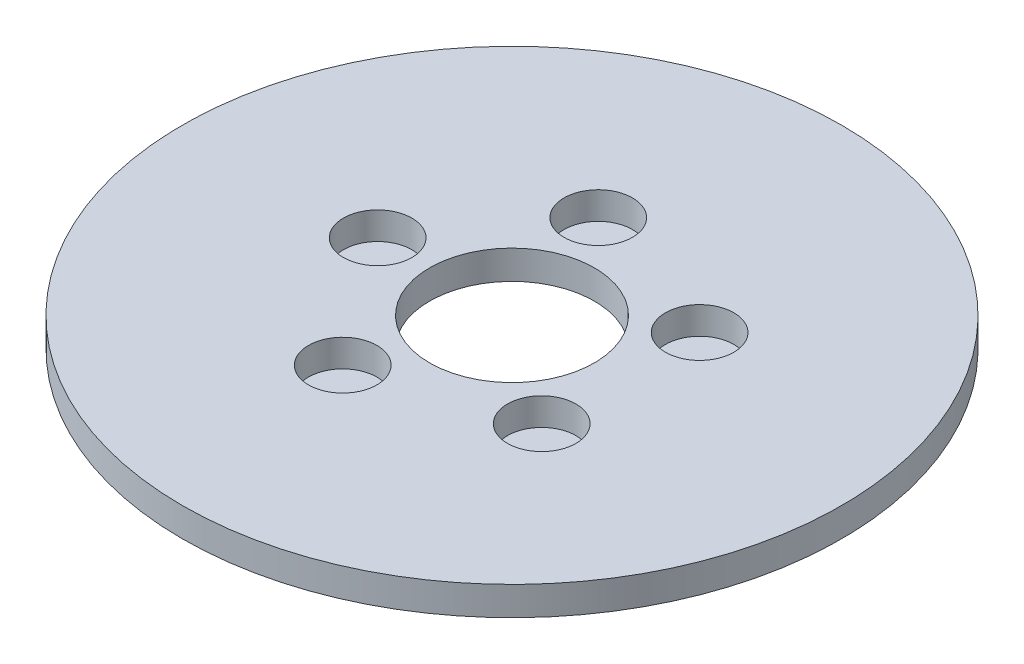
ISO-10303-21;
HEADER;
FILE_DESCRIPTION(('STEP AP214'),'2;1');
FILE_NAME('part.step','',(''),(''),'','','');
FILE_SCHEMA(('AUTOMOTIVE_DESIGN { 1 0 10303 214 1 1 1 1 }'));
ENDSEC;
DATA;
#1=APPLICATION_CONTEXT('core data for automotive mechanical design processes');
#2=APPLICATION_PROTOCOL_DEFINITION('international standard','automotive_design',2000,#1);
#3=PRODUCT_CONTEXT('',#1,'mechanical');
#4=PRODUCT('Part','Part','',(#3));
#5=PRODUCT_RELATED_PRODUCT_CATEGORY('part','',(#4));
#6=PRODUCT_DEFINITION_FORMATION('','',#4);
#7=PRODUCT_DEFINITION_CONTEXT('part definition',#1,'design');
#8=PRODUCT_DEFINITION('design','',#6,#7);
#9=PRODUCT_DEFINITION_SHAPE('','',#8);
#10=(LENGTH_UNIT() NAMED_UNIT(*) SI_UNIT(.MILLI.,.METRE.));
#11=(NAMED_UNIT(*) PLANE_ANGLE_UNIT() SI_UNIT($,.RADIAN.));
#12=(NAMED_UNIT(*) SI_UNIT($,.STERADIAN.) SOLID_ANGLE_UNIT());
#13=UNCERTAINTY_MEASURE_WITH_UNIT(LENGTH_MEASURE(1.E-05),#10,'distance_accuracy_value','');
#14=(GEOMETRIC_REPRESENTATION_CONTEXT(3) GLOBAL_UNCERTAINTY_ASSIGNED_CONTEXT((#13)) GLOBAL_UNIT_ASSIGNED_CONTEXT((#10,
#11,#12)) REPRESENTATION_CONTEXT('',''));
#15=CARTESIAN_POINT('',(0.,0.,0.));
#16=DIRECTION('',(0.,0.,1.));
#17=DIRECTION('',(1.,0.,0.));
#18=AXIS2_PLACEMENT_3D('',#15,#16,#17);
#19=CARTESIAN_POINT('',(0.,7.,0.));
#20=DIRECTION('',(0.,-1.,0.));
#21=DIRECTION('',(0.,0.,-1.));
#22=AXIS2_PLACEMENT_3D('',#19,#20,#21);
#23=CYLINDRICAL_SURFACE('',#22,80.);
#24=CARTESIAN_POINT('',(0.,7.,0.));
#25=DIRECTION('',(0.,1.,0.));
#26=DIRECTION('',(0.,0.,1.));
#27=AXIS2_PLACEMENT_3D('',#24,#25,#26);
#28=CIRCLE('',#27,80.);
#29=CARTESIAN_POINT('',(0.,7.,80.));
#30=VERTEX_POINT('',#29);
#31=EDGE_CURVE('E10',#30,#30,#28,.T.);
#32=ORIENTED_EDGE('',*,*,#31,.F.);
#33=EDGE_LOOP('',(#32));
#34=FACE_BOUND('',#33,.T.);
#35=CARTESIAN_POINT('',(0.,0.,0.));
#36=DIRECTION('',(0.,1.,0.));
#37=DIRECTION('',(0.,0.,1.));
#38=AXIS2_PLACEMENT_3D('',#35,#36,#37);
#39=CIRCLE('',#38,80.);
#40=CARTESIAN_POINT('',(0.,0.,80.));
#41=VERTEX_POINT('',#40);
#42=EDGE_CURVE('E37',#41,#41,#39,.T.);
#43=ORIENTED_EDGE('',*,*,#42,.T.);
#44=EDGE_LOOP('',(#43));
#45=FACE_BOUND('',#44,.T.);
#46=ADVANCED_FACE('F40',(#34,#45),#23,.T.);
#47=CARTESIAN_POINT('',(0.,7.,0.));
#48=DIRECTION('',(0.,1.,0.));
#49=DIRECTION('',(0.,0.,1.));
#50=AXIS2_PLACEMENT_3D('',#47,#48,#49);
#51=PLANE('',#50);
#52=CARTESIAN_POINT('',(-10.0772122075508,7.,-31.0144701117994));
#53=DIRECTION('',(0.,1.,0.));
#54=DIRECTION('',(-0.95105651629515,0.,0.309016994374958));
#55=AXIS2_PLACEMENT_3D('',#52,#53,#54);
#56=CIRCLE('',#55,8.30607325850984);
#57=CARTESIAN_POINT('',(-17.9767573048815,7.,-28.4477523183965));
#58=VERTEX_POINT('',#57);
#59=EDGE_CURVE('E70',#58,#58,#56,.T.);
#60=ORIENTED_EDGE('',*,*,#59,.F.);
#61=EDGE_LOOP('',(#60));
#62=FACE_BOUND('',#61,.T.);
#63=CARTESIAN_POINT('',(26.3824840712123,7.,-19.1679966721601));
#64=DIRECTION('',(0.,1.,0.));
#65=DIRECTION('',(-0.58778525229248,0.,-0.809016994374942));
#66=AXIS2_PLACEMENT_3D('',#63,#64,#65);
#67=CIRCLE('',#66,8.30607325850984);
#68=CARTESIAN_POINT('',(21.5002967053992,7.,-25.8877510948178));
#69=VERTEX_POINT('',#68);
#70=EDGE_CURVE('E71',#69,#69,#67,.T.);
#71=ORIENTED_EDGE('',*,*,#70,.F.);
#72=EDGE_LOOP('',(#71));
#73=FACE_BOUND('',#72,.T.);
#74=CARTESIAN_POINT('',(26.3824840712126,7.,19.1679966721597));
#75=DIRECTION('',(0.,1.,0.));
#76=DIRECTION('',(0.587785252292469,0.,-0.809016994374951));
#77=AXIS2_PLACEMENT_3D('',#74,#75,#76);
#78=CIRCLE('',#77,8.30607325850984);
#79=CARTESIAN_POINT('',(31.2646714370255,7.,12.4482422495019));
#80=VERTEX_POINT('',#79);
#81=EDGE_CURVE('E78',#80,#80,#78,.T.);
#82=ORIENTED_EDGE('',*,*,#81,.F.);
#83=EDGE_LOOP('',(#82));
#84=FACE_BOUND('',#83,.T.);
#85=CARTESIAN_POINT('',(-10.0772122075504,7.,31.0144701117996));
#86=DIRECTION('',(0.,1.,0.));
#87=DIRECTION('',(0.951056516295155,0.,0.309016994374945));
#88=AXIS2_PLACEMENT_3D('',#85,#86,#87);
#89=CIRCLE('',#88,8.30607325850984);
#90=CARTESIAN_POINT('',(-2.17766711021965,7.,33.5811879052024));
#91=VERTEX_POINT('',#90);
#92=EDGE_CURVE('E61',#91,#91,#89,.T.);
#93=ORIENTED_EDGE('',*,*,#92,.F.);
#94=EDGE_LOOP('',(#93));
#95=FACE_BOUND('',#94,.T.);
#96=CARTESIAN_POINT('',(-32.610543727324,7.,0.));
#97=DIRECTION('',(0.,1.,0.));
#98=DIRECTION('',(0.,0.,1.));
#99=AXIS2_PLACEMENT_3D('',#96,#97,#98);
#100=CIRCLE('',#99,8.30607325850984);
#101=CARTESIAN_POINT('',(-32.610543727324,7.,8.30607325850984));
#102=VERTEX_POINT('',#101);
#103=EDGE_CURVE('E54',#102,#102,#100,.T.);
#104=ORIENTED_EDGE('',*,*,#103,.F.);
#105=EDGE_LOOP('',(#104));
#106=FACE_BOUND('',#105,.T.);
#107=CARTESIAN_POINT('',(0.,7.,0.));
#108=DIRECTION('',(0.,1.,0.));
#109=DIRECTION('',(0.,0.,1.));
#110=AXIS2_PLACEMENT_3D('',#107,#108,#109);
#111=CIRCLE('',#110,20.);
#112=CARTESIAN_POINT('',(0.,7.,20.));
#113=VERTEX_POINT('',#112);
#114=EDGE_CURVE('E50',#113,#113,#111,.T.);
#115=ORIENTED_EDGE('',*,*,#114,.F.);
#116=EDGE_LOOP('',(#115));
#117=FACE_BOUND('',#116,.T.);
#118=ORIENTED_EDGE('',*,*,#31,.T.);
#119=EDGE_LOOP('',(#118));
#120=FACE_BOUND('',#119,.T.);
#121=ADVANCED_FACE('F94',(#62,#73,#84,#95,#106,#117,#120),#51,.T.);
#122=CARTESIAN_POINT('',(0.,0.,0.));
#123=DIRECTION('',(0.,1.,0.));
#124=DIRECTION('',(0.,0.,1.));
#125=AXIS2_PLACEMENT_3D('',#122,#123,#124);
#126=PLANE('',#125);
#127=CARTESIAN_POINT('',(0.,0.,0.));
#128=DIRECTION('',(0.,1.,0.));
#129=DIRECTION('',(0.,0.,1.));
#130=AXIS2_PLACEMENT_3D('',#127,#128,#129);
#131=CIRCLE('',#130,20.);
#132=CARTESIAN_POINT('',(0.,0.,20.));
#133=VERTEX_POINT('',#132);
#134=EDGE_CURVE('E47',#133,#133,#131,.T.);
#135=ORIENTED_EDGE('',*,*,#134,.T.);
#136=EDGE_LOOP('',(#135));
#137=FACE_BOUND('',#136,.T.);
#138=ORIENTED_EDGE('',*,*,#42,.F.);
#139=EDGE_LOOP('',(#138));
#140=FACE_BOUND('',#139,.T.);
#141=ADVANCED_FACE('F100',(#137,#140),#126,.F.);
#142=CARTESIAN_POINT('',(0.,7.,0.));
#143=DIRECTION('',(0.,-1.,0.));
#144=DIRECTION('',(0.,0.,-1.));
#145=AXIS2_PLACEMENT_3D('',#142,#143,#144);
#146=CYLINDRICAL_SURFACE('',#145,20.);
#147=ORIENTED_EDGE('',*,*,#114,.T.);
#148=EDGE_LOOP('',(#147));
#149=FACE_BOUND('',#148,.T.);
#150=ORIENTED_EDGE('',*,*,#134,.F.);
#151=EDGE_LOOP('',(#150));
#152=FACE_BOUND('',#151,.T.);
#153=ADVANCED_FACE('F106',(#149,#152),#146,.F.);
#154=CARTESIAN_POINT('',(-32.610543727324,0.341908632749636,0.));
#155=DIRECTION('',(0.,1.,0.));
#156=DIRECTION('',(0.,0.,1.));
#157=AXIS2_PLACEMENT_3D('',#154,#155,#156);
#158=CYLINDRICAL_SURFACE('',#157,8.30607325850984);
#159=CARTESIAN_POINT('',(-32.610543727324,0.341908632749636,0.));
#160=DIRECTION('',(0.,1.,0.));
#161=DIRECTION('',(0.,0.,1.));
#162=AXIS2_PLACEMENT_3D('',#159,#160,#161);
#163=CIRCLE('',#162,8.30607325850984);
#164=CARTESIAN_POINT('',(-32.610543727324,0.341908632749636,8.30607325850984));
#165=VERTEX_POINT('',#164);
#166=EDGE_CURVE('E55',#165,#165,#163,.T.);
#167=ORIENTED_EDGE('',*,*,#166,.F.);
#168=EDGE_LOOP('',(#167));
#169=FACE_BOUND('',#168,.T.);
#170=ORIENTED_EDGE('',*,*,#103,.T.);
#171=EDGE_LOOP('',(#170));
#172=FACE_BOUND('',#171,.T.);
#173=ADVANCED_FACE('F108',(#169,#172),#158,.F.);
#174=CARTESIAN_POINT('',(-32.610543727324,0.341908632749636,0.));
#175=DIRECTION('',(0.,1.,0.));
#176=DIRECTION('',(0.,0.,1.));
#177=AXIS2_PLACEMENT_3D('',#174,#175,#176);
#178=PLANE('',#177);
#179=ORIENTED_EDGE('',*,*,#166,.T.);
#180=EDGE_LOOP('',(#179));
#181=FACE_BOUND('',#180,.T.);
#182=ADVANCED_FACE('F138',(#181),#178,.T.);
#183=CARTESIAN_POINT('',(-10.0772122075504,0.341908632749636,31.0144701117996));
#184=DIRECTION('',(0.,1.,0.));
#185=DIRECTION('',(0.,0.,1.));
#186=AXIS2_PLACEMENT_3D('',#183,#184,#185);
#187=CYLINDRICAL_SURFACE('',#186,8.30607325850984);
#188=CARTESIAN_POINT('',(-10.0772122075504,0.341908632749636,31.0144701117996));
#189=DIRECTION('',(0.,1.,0.));
#190=DIRECTION('',(0.951056516295155,0.,0.309016994374945));
#191=AXIS2_PLACEMENT_3D('',#188,#189,#190);
#192=CIRCLE('',#191,8.30607325850984);
#193=CARTESIAN_POINT('',(-2.17766711021965,0.341908632749636,33.5811879052024));
#194=VERTEX_POINT('',#193);
#195=EDGE_CURVE('E59',#194,#194,#192,.T.);
#196=ORIENTED_EDGE('',*,*,#195,.F.);
#197=EDGE_LOOP('',(#196));
#198=FACE_BOUND('',#197,.T.);
#199=ORIENTED_EDGE('',*,*,#92,.T.);
#200=EDGE_LOOP('',(#199));
#201=FACE_BOUND('',#200,.T.);
#202=ADVANCED_FACE('F150',(#198,#201),#187,.F.);
#203=CARTESIAN_POINT('',(-10.0772122075504,0.341908632749636,31.0144701117996));
#204=DIRECTION('',(0.,1.,0.));
#205=DIRECTION('',(0.951056516295155,0.,0.309016994374945));
#206=AXIS2_PLACEMENT_3D('',#203,#204,#205);
#207=PLANE('',#206);
#208=ORIENTED_EDGE('',*,*,#195,.T.);
#209=EDGE_LOOP('',(#208));
#210=FACE_BOUND('',#209,.T.);
#211=ADVANCED_FACE('F89',(#210),#207,.T.);
#212=CARTESIAN_POINT('',(26.3824840712126,0.341908632749636,19.1679966721597));
#213=DIRECTION('',(0.,1.,0.));
#214=DIRECTION('',(0.,0.,1.));
#215=AXIS2_PLACEMENT_3D('',#212,#213,#214);
#216=CYLINDRICAL_SURFACE('',#215,8.30607325850984);
#217=CARTESIAN_POINT('',(26.3824840712126,0.341908632749636,19.1679966721597));
#218=DIRECTION('',(0.,1.,0.));
#219=DIRECTION('',(0.587785252292469,0.,-0.809016994374951));
#220=AXIS2_PLACEMENT_3D('',#217,#218,#219);
#221=CIRCLE('',#220,8.30607325850984);
#222=CARTESIAN_POINT('',(31.2646714370255,0.341908632749636,12.4482422495019));
#223=VERTEX_POINT('',#222);
#224=EDGE_CURVE('E63',#223,#223,#221,.T.);
#225=ORIENTED_EDGE('',*,*,#224,.F.);
#226=EDGE_LOOP('',(#225));
#227=FACE_BOUND('',#226,.T.);
#228=ORIENTED_EDGE('',*,*,#81,.T.);
#229=EDGE_LOOP('',(#228));
#230=FACE_BOUND('',#229,.T.);
#231=ADVANCED_FACE('F87',(#227,#230),#216,.F.);
#232=CARTESIAN_POINT('',(26.3824840712126,0.341908632749636,19.1679966721597));
#233=DIRECTION('',(0.,1.,0.));
#234=DIRECTION('',(0.587785252292469,0.,-0.809016994374951));
#235=AXIS2_PLACEMENT_3D('',#232,#233,#234);
#236=PLANE('',#235);
#237=ORIENTED_EDGE('',*,*,#224,.T.);
#238=EDGE_LOOP('',(#237));
#239=FACE_BOUND('',#238,.T.);
#240=ADVANCED_FACE('F84',(#239),#236,.T.);
#241=CARTESIAN_POINT('',(26.3824840712123,0.341908632749636,-19.1679966721601));
#242=DIRECTION('',(0.,1.,0.));
#243=DIRECTION('',(0.,0.,1.));
#244=AXIS2_PLACEMENT_3D('',#241,#242,#243);
#245=CYLINDRICAL_SURFACE('',#244,8.30607325850984);
#246=CARTESIAN_POINT('',(26.3824840712123,0.341908632749636,-19.1679966721601));
#247=DIRECTION('',(0.,1.,0.));
#248=DIRECTION('',(-0.58778525229248,0.,-0.809016994374942));
#249=AXIS2_PLACEMENT_3D('',#246,#247,#248);
#250=CIRCLE('',#249,8.30607325850984);
#251=CARTESIAN_POINT('',(21.5002967053992,0.341908632749636,-25.8877510948178));
#252=VERTEX_POINT('',#251);
#253=EDGE_CURVE('E76',#252,#252,#250,.T.);
#254=ORIENTED_EDGE('',*,*,#253,.F.);
#255=EDGE_LOOP('',(#254));
#256=FACE_BOUND('',#255,.T.);
#257=ORIENTED_EDGE('',*,*,#70,.T.);
#258=EDGE_LOOP('',(#257));
#259=FACE_BOUND('',#258,.T.);
#260=ADVANCED_FACE('F185',(#256,#259),#245,.F.);
#261=CARTESIAN_POINT('',(26.3824840712123,0.341908632749636,-19.1679966721601));
#262=DIRECTION('',(0.,1.,0.));
#263=DIRECTION('',(-0.58778525229248,0.,-0.809016994374942));
#264=AXIS2_PLACEMENT_3D('',#261,#262,#263);
#265=PLANE('',#264);
#266=ORIENTED_EDGE('',*,*,#253,.T.);
#267=EDGE_LOOP('',(#266));
#268=FACE_BOUND('',#267,.T.);
#269=ADVANCED_FACE('F189',(#268),#265,.T.);
#270=CARTESIAN_POINT('',(-10.0772122075508,0.341908632749636,-31.0144701117994));
#271=DIRECTION('',(0.,1.,0.));
#272=DIRECTION('',(0.,0.,1.));
#273=AXIS2_PLACEMENT_3D('',#270,#271,#272);
#274=CYLINDRICAL_SURFACE('',#273,8.30607325850984);
#275=CARTESIAN_POINT('',(-10.0772122075508,0.341908632749636,-31.0144701117994));
#276=DIRECTION('',(0.,1.,0.));
#277=DIRECTION('',(-0.95105651629515,0.,0.309016994374958));
#278=AXIS2_PLACEMENT_3D('',#275,#276,#277);
#279=CIRCLE('',#278,8.30607325850984);
#280=CARTESIAN_POINT('',(-17.9767573048815,0.341908632749636,-28.4477523183965));
#281=VERTEX_POINT('',#280);
#282=EDGE_CURVE('E69',#281,#281,#279,.T.);
#283=ORIENTED_EDGE('',*,*,#282,.F.);
#284=EDGE_LOOP('',(#283));
#285=FACE_BOUND('',#284,.T.);
#286=ORIENTED_EDGE('',*,*,#59,.T.);
#287=EDGE_LOOP('',(#286));
#288=FACE_BOUND('',#287,.T.);
#289=ADVANCED_FACE('F200',(#285,#288),#274,.F.);
#290=CARTESIAN_POINT('',(-10.0772122075508,0.341908632749636,-31.0144701117994));
#291=DIRECTION('',(0.,1.,0.));
#292=DIRECTION('',(-0.95105651629515,0.,0.309016994374958));
#293=AXIS2_PLACEMENT_3D('',#290,#291,#292);
#294=PLANE('',#293);
#295=ORIENTED_EDGE('',*,*,#282,.T.);
#296=EDGE_LOOP('',(#295));
#297=FACE_BOUND('',#296,.T.);
#298=ADVANCED_FACE('F208',(#297),#294,.T.);
#299=CLOSED_SHELL('',(#46,#121,#141,#153,#173,#182,#202,#211,#231,#240,#260,#269,#289,#298));
#300=MANIFOLD_SOLID_BREP('B2',#299);
#301=ADVANCED_BREP_SHAPE_REPRESENTATION('',(#18,#300),#14);
#302=SHAPE_DEFINITION_REPRESENTATION(#9,#301);
ENDSEC;
END-ISO-10303-21;
